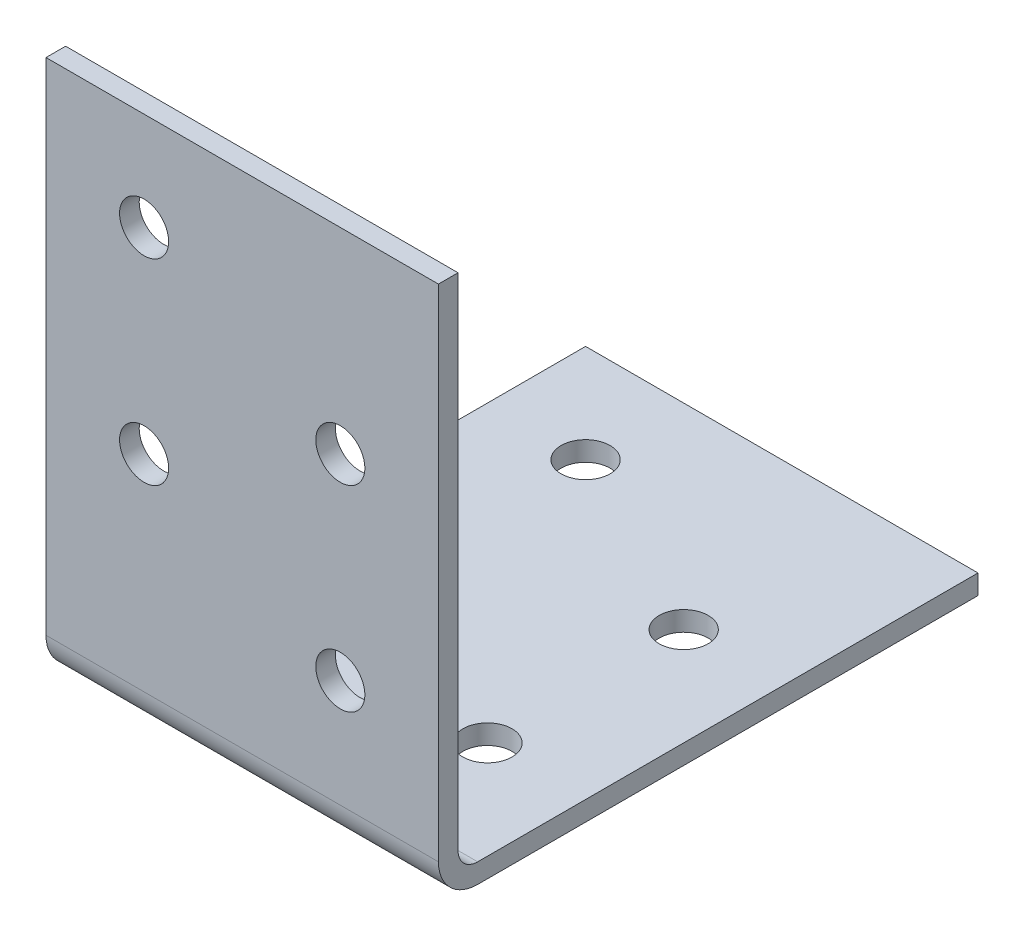
ISO-10303-21;
HEADER;
FILE_DESCRIPTION(('STEP AP214'),'2;1');
FILE_NAME('part.step','',(''),(''),'','','');
FILE_SCHEMA(('AUTOMOTIVE_DESIGN { 1 0 10303 214 1 1 1 1 }'));
ENDSEC;
DATA;
#1=APPLICATION_CONTEXT('core data for automotive mechanical design processes');
#2=APPLICATION_PROTOCOL_DEFINITION('international standard','automotive_design',2000,#1);
#3=PRODUCT_CONTEXT('',#1,'mechanical');
#4=PRODUCT('Part','Part','',(#3));
#5=PRODUCT_RELATED_PRODUCT_CATEGORY('part','',(#4));
#6=PRODUCT_DEFINITION_FORMATION('','',#4);
#7=PRODUCT_DEFINITION_CONTEXT('part definition',#1,'design');
#8=PRODUCT_DEFINITION('design','',#6,#7);
#9=PRODUCT_DEFINITION_SHAPE('','',#8);
#10=(LENGTH_UNIT() NAMED_UNIT(*) SI_UNIT(.MILLI.,.METRE.));
#11=(NAMED_UNIT(*) PLANE_ANGLE_UNIT() SI_UNIT($,.RADIAN.));
#12=(NAMED_UNIT(*) SI_UNIT($,.STERADIAN.) SOLID_ANGLE_UNIT());
#13=UNCERTAINTY_MEASURE_WITH_UNIT(LENGTH_MEASURE(1.E-05),#10,'distance_accuracy_value','');
#14=(GEOMETRIC_REPRESENTATION_CONTEXT(3) GLOBAL_UNCERTAINTY_ASSIGNED_CONTEXT((#13)) GLOBAL_UNIT_ASSIGNED_CONTEXT((#10,
#11,#12)) REPRESENTATION_CONTEXT('',''));
#15=CARTESIAN_POINT('',(0.,0.,0.));
#16=DIRECTION('',(0.,0.,1.));
#17=DIRECTION('',(1.,0.,0.));
#18=AXIS2_PLACEMENT_3D('',#15,#16,#17);
#19=CARTESIAN_POINT('',(20.,55.,0.));
#20=DIRECTION('',(0.,-1.,0.));
#21=DIRECTION('',(0.,0.,-1.));
#22=AXIS2_PLACEMENT_3D('',#19,#20,#21);
#23=PLANE('',#22);
#24=DIRECTION('',(0.,0.,1.));
#25=VECTOR('',#24,1.);
#26=CARTESIAN_POINT('',(-20.,55.,0.));
#27=LINE('',#26,#25);
#28=CARTESIAN_POINT('',(-20.,55.,-2.));
#29=VERTEX_POINT('',#28);
#30=CARTESIAN_POINT('',(-20.,55.,0.));
#31=VERTEX_POINT('',#30);
#32=EDGE_CURVE('E141',#29,#31,#27,.T.);
#33=ORIENTED_EDGE('',*,*,#32,.T.);
#34=DIRECTION('',(-1.,0.,0.));
#35=VECTOR('',#34,1.);
#36=CARTESIAN_POINT('',(20.,55.,0.));
#37=LINE('',#36,#35);
#38=CARTESIAN_POINT('',(20.,55.,0.));
#39=VERTEX_POINT('',#38);
#40=EDGE_CURVE('E11',#39,#31,#37,.T.);
#41=ORIENTED_EDGE('',*,*,#40,.F.);
#42=DIRECTION('',(0.,0.,1.));
#43=VECTOR('',#42,1.);
#44=CARTESIAN_POINT('',(20.,55.,0.));
#45=LINE('',#44,#43);
#46=CARTESIAN_POINT('',(20.,55.,-2.));
#47=VERTEX_POINT('',#46);
#48=EDGE_CURVE('E164',#47,#39,#45,.T.);
#49=ORIENTED_EDGE('',*,*,#48,.F.);
#50=DIRECTION('',(-1.,0.,0.));
#51=VECTOR('',#50,1.);
#52=CARTESIAN_POINT('',(20.,55.,-2.));
#53=LINE('',#52,#51);
#54=EDGE_CURVE('E137',#47,#29,#53,.T.);
#55=ORIENTED_EDGE('',*,*,#54,.T.);
#56=EDGE_LOOP('',(#33,#41,#49,#55));
#57=FACE_BOUND('',#56,.T.);
#58=ADVANCED_FACE('F40',(#57),#23,.F.);
#59=CARTESIAN_POINT('',(20.,55.,0.));
#60=DIRECTION('',(0.,0.,-1.));
#61=DIRECTION('',(0.,1.,0.));
#62=AXIS2_PLACEMENT_3D('',#59,#60,#61);
#63=PLANE('',#62);
#64=CARTESIAN_POINT('',(10.,15.,0.));
#65=DIRECTION('',(0.,0.,-1.));
#66=DIRECTION('',(-1.,0.,0.));
#67=AXIS2_PLACEMENT_3D('',#64,#65,#66);
#68=CIRCLE('',#67,2.5);
#69=CARTESIAN_POINT('',(7.5,15.,0.));
#70=VERTEX_POINT('',#69);
#71=EDGE_CURVE('E263',#70,#70,#68,.T.);
#72=ORIENTED_EDGE('',*,*,#71,.T.);
#73=EDGE_LOOP('',(#72));
#74=FACE_BOUND('',#73,.T.);
#75=CARTESIAN_POINT('',(10.,35.,0.));
#76=DIRECTION('',(0.,0.,-1.));
#77=DIRECTION('',(-1.,0.,0.));
#78=AXIS2_PLACEMENT_3D('',#75,#76,#77);
#79=CIRCLE('',#78,2.5);
#80=CARTESIAN_POINT('',(7.5,35.,0.));
#81=VERTEX_POINT('',#80);
#82=EDGE_CURVE('E255',#81,#81,#79,.T.);
#83=ORIENTED_EDGE('',*,*,#82,.T.);
#84=EDGE_LOOP('',(#83));
#85=FACE_BOUND('',#84,.T.);
#86=CARTESIAN_POINT('',(-10.,25.,0.));
#87=DIRECTION('',(0.,0.,-1.));
#88=DIRECTION('',(-1.,0.,0.));
#89=AXIS2_PLACEMENT_3D('',#86,#87,#88);
#90=CIRCLE('',#89,2.5);
#91=CARTESIAN_POINT('',(-12.5,25.,0.));
#92=VERTEX_POINT('',#91);
#93=EDGE_CURVE('E247',#92,#92,#90,.T.);
#94=ORIENTED_EDGE('',*,*,#93,.T.);
#95=EDGE_LOOP('',(#94));
#96=FACE_BOUND('',#95,.T.);
#97=CARTESIAN_POINT('',(-10.,45.,0.));
#98=DIRECTION('',(0.,0.,-1.));
#99=DIRECTION('',(-1.,0.,0.));
#100=AXIS2_PLACEMENT_3D('',#97,#98,#99);
#101=CIRCLE('',#100,2.5);
#102=CARTESIAN_POINT('',(-12.5,45.,0.));
#103=VERTEX_POINT('',#102);
#104=EDGE_CURVE('E239',#103,#103,#101,.T.);
#105=ORIENTED_EDGE('',*,*,#104,.T.);
#106=EDGE_LOOP('',(#105));
#107=FACE_BOUND('',#106,.T.);
#108=DIRECTION('',(0.,-1.,0.));
#109=VECTOR('',#108,1.);
#110=CARTESIAN_POINT('',(-20.,55.,0.));
#111=LINE('',#110,#109);
#112=CARTESIAN_POINT('',(-20.,4.00000000000003,0.));
#113=VERTEX_POINT('',#112);
#114=EDGE_CURVE('E145',#31,#113,#111,.T.);
#115=ORIENTED_EDGE('',*,*,#114,.T.);
#116=DIRECTION('',(-1.,0.,0.));
#117=VECTOR('',#116,1.);
#118=CARTESIAN_POINT('',(20.,4.00000000000003,0.));
#119=LINE('',#118,#117);
#120=CARTESIAN_POINT('',(20.,4.00000000000003,0.));
#121=VERTEX_POINT('',#120);
#122=EDGE_CURVE('E49',#121,#113,#119,.T.);
#123=ORIENTED_EDGE('',*,*,#122,.F.);
#124=DIRECTION('',(0.,-1.,0.));
#125=VECTOR('',#124,1.);
#126=CARTESIAN_POINT('',(20.,55.,0.));
#127=LINE('',#126,#125);
#128=EDGE_CURVE('E100',#39,#121,#127,.T.);
#129=ORIENTED_EDGE('',*,*,#128,.F.);
#130=ORIENTED_EDGE('',*,*,#40,.T.);
#131=EDGE_LOOP('',(#115,#123,#129,#130));
#132=FACE_BOUND('',#131,.T.);
#133=ADVANCED_FACE('F302',(#74,#85,#96,#107,#132),#63,.F.);
#134=CARTESIAN_POINT('',(20.,4.,-4.));
#135=DIRECTION('',(-1.,0.,0.));
#136=DIRECTION('',(0.,0.,1.));
#137=AXIS2_PLACEMENT_3D('',#134,#135,#136);
#138=CYLINDRICAL_SURFACE('',#137,4.);
#139=CARTESIAN_POINT('',(-20.,4.,-4.));
#140=DIRECTION('',(1.,0.,0.));
#141=DIRECTION('',(0.,0.,-1.));
#142=AXIS2_PLACEMENT_3D('',#139,#140,#141);
#143=CIRCLE('',#142,4.);
#144=CARTESIAN_POINT('',(-20.,0.,-4.00000000000003));
#145=VERTEX_POINT('',#144);
#146=EDGE_CURVE('E149',#113,#145,#143,.T.);
#147=ORIENTED_EDGE('',*,*,#146,.T.);
#148=DIRECTION('',(-1.,0.,0.));
#149=VECTOR('',#148,1.);
#150=CARTESIAN_POINT('',(20.,0.,-4.00000000000003));
#151=LINE('',#150,#149);
#152=CARTESIAN_POINT('',(20.,0.,-4.00000000000003));
#153=VERTEX_POINT('',#152);
#154=EDGE_CURVE('E175',#153,#145,#151,.T.);
#155=ORIENTED_EDGE('',*,*,#154,.F.);
#156=CARTESIAN_POINT('',(20.,4.,-4.));
#157=DIRECTION('',(1.,0.,0.));
#158=DIRECTION('',(0.,0.,-1.));
#159=AXIS2_PLACEMENT_3D('',#156,#157,#158);
#160=CIRCLE('',#159,4.);
#161=EDGE_CURVE('E185',#121,#153,#160,.T.);
#162=ORIENTED_EDGE('',*,*,#161,.F.);
#163=ORIENTED_EDGE('',*,*,#122,.T.);
#164=EDGE_LOOP('',(#147,#155,#162,#163));
#165=FACE_BOUND('',#164,.T.);
#166=ADVANCED_FACE('F183',(#165),#138,.T.);
#167=CARTESIAN_POINT('',(20.,0.,-4.00000000000003));
#168=DIRECTION('',(0.,1.,0.));
#169=DIRECTION('',(0.,0.,1.));
#170=AXIS2_PLACEMENT_3D('',#167,#168,#169);
#171=PLANE('',#170);
#172=CARTESIAN_POINT('',(-10.,0.,-45.));
#173=DIRECTION('',(0.,1.,0.));
#174=DIRECTION('',(0.,0.,1.));
#175=AXIS2_PLACEMENT_3D('',#172,#173,#174);
#176=CIRCLE('',#175,2.5);
#177=CARTESIAN_POINT('',(-10.,0.,-42.5));
#178=VERTEX_POINT('',#177);
#179=EDGE_CURVE('E231',#178,#178,#176,.T.);
#180=ORIENTED_EDGE('',*,*,#179,.T.);
#181=EDGE_LOOP('',(#180));
#182=FACE_BOUND('',#181,.T.);
#183=CARTESIAN_POINT('',(-10.,0.,-25.));
#184=DIRECTION('',(0.,1.,0.));
#185=DIRECTION('',(0.,0.,1.));
#186=AXIS2_PLACEMENT_3D('',#183,#184,#185);
#187=CIRCLE('',#186,2.5);
#188=CARTESIAN_POINT('',(-10.,0.,-22.5));
#189=VERTEX_POINT('',#188);
#190=EDGE_CURVE('E223',#189,#189,#187,.T.);
#191=ORIENTED_EDGE('',*,*,#190,.T.);
#192=EDGE_LOOP('',(#191));
#193=FACE_BOUND('',#192,.T.);
#194=CARTESIAN_POINT('',(10.,0.,-35.));
#195=DIRECTION('',(0.,1.,0.));
#196=DIRECTION('',(0.,0.,1.));
#197=AXIS2_PLACEMENT_3D('',#194,#195,#196);
#198=CIRCLE('',#197,2.5);
#199=CARTESIAN_POINT('',(10.,0.,-32.5));
#200=VERTEX_POINT('',#199);
#201=EDGE_CURVE('E215',#200,#200,#198,.T.);
#202=ORIENTED_EDGE('',*,*,#201,.T.);
#203=EDGE_LOOP('',(#202));
#204=FACE_BOUND('',#203,.T.);
#205=CARTESIAN_POINT('',(10.,0.,-15.));
#206=DIRECTION('',(0.,1.,0.));
#207=DIRECTION('',(0.,0.,1.));
#208=AXIS2_PLACEMENT_3D('',#205,#206,#207);
#209=CIRCLE('',#208,2.5);
#210=CARTESIAN_POINT('',(10.,0.,-12.5));
#211=VERTEX_POINT('',#210);
#212=EDGE_CURVE('E146',#211,#211,#209,.T.);
#213=ORIENTED_EDGE('',*,*,#212,.T.);
#214=EDGE_LOOP('',(#213));
#215=FACE_BOUND('',#214,.T.);
#216=DIRECTION('',(0.,0.,-1.));
#217=VECTOR('',#216,1.);
#218=CARTESIAN_POINT('',(-20.,0.,-4.00000000000003));
#219=LINE('',#218,#217);
#220=CARTESIAN_POINT('',(-20.,0.,-55.));
#221=VERTEX_POINT('',#220);
#222=EDGE_CURVE('E152',#145,#221,#219,.T.);
#223=ORIENTED_EDGE('',*,*,#222,.T.);
#224=DIRECTION('',(-1.,0.,0.));
#225=VECTOR('',#224,1.);
#226=CARTESIAN_POINT('',(20.,0.,-55.));
#227=LINE('',#226,#225);
#228=CARTESIAN_POINT('',(20.,0.,-55.));
#229=VERTEX_POINT('',#228);
#230=EDGE_CURVE('E171',#229,#221,#227,.T.);
#231=ORIENTED_EDGE('',*,*,#230,.F.);
#232=DIRECTION('',(0.,0.,-1.));
#233=VECTOR('',#232,1.);
#234=CARTESIAN_POINT('',(20.,0.,-4.00000000000003));
#235=LINE('',#234,#233);
#236=EDGE_CURVE('E198',#153,#229,#235,.T.);
#237=ORIENTED_EDGE('',*,*,#236,.F.);
#238=ORIENTED_EDGE('',*,*,#154,.T.);
#239=EDGE_LOOP('',(#223,#231,#237,#238));
#240=FACE_BOUND('',#239,.T.);
#241=ADVANCED_FACE('F193',(#182,#193,#204,#215,#240),#171,.F.);
#242=CARTESIAN_POINT('',(20.,2.,-55.));
#243=DIRECTION('',(0.,0.,1.));
#244=DIRECTION('',(1.,0.,0.));
#245=AXIS2_PLACEMENT_3D('',#242,#243,#244);
#246=PLANE('',#245);
#247=DIRECTION('',(0.,1.,0.));
#248=VECTOR('',#247,1.);
#249=CARTESIAN_POINT('',(-20.,2.,-55.));
#250=LINE('',#249,#248);
#251=CARTESIAN_POINT('',(-20.,2.,-55.));
#252=VERTEX_POINT('',#251);
#253=EDGE_CURVE('E155',#221,#252,#250,.T.);
#254=ORIENTED_EDGE('',*,*,#253,.T.);
#255=DIRECTION('',(-1.,0.,0.));
#256=VECTOR('',#255,1.);
#257=CARTESIAN_POINT('',(20.,2.,-55.));
#258=LINE('',#257,#256);
#259=CARTESIAN_POINT('',(20.,2.,-55.));
#260=VERTEX_POINT('',#259);
#261=EDGE_CURVE('E130',#260,#252,#258,.T.);
#262=ORIENTED_EDGE('',*,*,#261,.F.);
#263=DIRECTION('',(0.,1.,0.));
#264=VECTOR('',#263,1.);
#265=CARTESIAN_POINT('',(20.,2.,-55.));
#266=LINE('',#265,#264);
#267=EDGE_CURVE('E119',#229,#260,#266,.T.);
#268=ORIENTED_EDGE('',*,*,#267,.F.);
#269=ORIENTED_EDGE('',*,*,#230,.T.);
#270=EDGE_LOOP('',(#254,#262,#268,#269));
#271=FACE_BOUND('',#270,.T.);
#272=ADVANCED_FACE('F196',(#271),#246,.F.);
#273=CARTESIAN_POINT('',(20.,2.,-4.00000000000001));
#274=DIRECTION('',(0.,-1.,0.));
#275=DIRECTION('',(0.,0.,-1.));
#276=AXIS2_PLACEMENT_3D('',#273,#274,#275);
#277=PLANE('',#276);
#278=CARTESIAN_POINT('',(-10.,2.,-45.));
#279=DIRECTION('',(0.,1.,0.));
#280=DIRECTION('',(0.,0.,1.));
#281=AXIS2_PLACEMENT_3D('',#278,#279,#280);
#282=CIRCLE('',#281,2.5);
#283=CARTESIAN_POINT('',(-10.,2.,-42.5));
#284=VERTEX_POINT('',#283);
#285=EDGE_CURVE('E235',#284,#284,#282,.T.);
#286=ORIENTED_EDGE('',*,*,#285,.F.);
#287=EDGE_LOOP('',(#286));
#288=FACE_BOUND('',#287,.T.);
#289=CARTESIAN_POINT('',(-10.,2.,-25.));
#290=DIRECTION('',(0.,1.,0.));
#291=DIRECTION('',(0.,0.,1.));
#292=AXIS2_PLACEMENT_3D('',#289,#290,#291);
#293=CIRCLE('',#292,2.5);
#294=CARTESIAN_POINT('',(-10.,2.,-22.5));
#295=VERTEX_POINT('',#294);
#296=EDGE_CURVE('E227',#295,#295,#293,.T.);
#297=ORIENTED_EDGE('',*,*,#296,.F.);
#298=EDGE_LOOP('',(#297));
#299=FACE_BOUND('',#298,.T.);
#300=CARTESIAN_POINT('',(10.,2.,-35.));
#301=DIRECTION('',(0.,1.,0.));
#302=DIRECTION('',(0.,0.,1.));
#303=AXIS2_PLACEMENT_3D('',#300,#301,#302);
#304=CIRCLE('',#303,2.5);
#305=CARTESIAN_POINT('',(10.,2.,-32.5));
#306=VERTEX_POINT('',#305);
#307=EDGE_CURVE('E219',#306,#306,#304,.T.);
#308=ORIENTED_EDGE('',*,*,#307,.F.);
#309=EDGE_LOOP('',(#308));
#310=FACE_BOUND('',#309,.T.);
#311=CARTESIAN_POINT('',(10.,2.,-15.));
#312=DIRECTION('',(0.,1.,0.));
#313=DIRECTION('',(0.,0.,1.));
#314=AXIS2_PLACEMENT_3D('',#311,#312,#313);
#315=CIRCLE('',#314,2.5);
#316=CARTESIAN_POINT('',(10.,2.,-12.5));
#317=VERTEX_POINT('',#316);
#318=EDGE_CURVE('E211',#317,#317,#315,.T.);
#319=ORIENTED_EDGE('',*,*,#318,.F.);
#320=EDGE_LOOP('',(#319));
#321=FACE_BOUND('',#320,.T.);
#322=DIRECTION('',(0.,0.,1.));
#323=VECTOR('',#322,1.);
#324=CARTESIAN_POINT('',(-20.,2.,-4.00000000000001));
#325=LINE('',#324,#323);
#326=CARTESIAN_POINT('',(-20.,2.,-4.00000000000001));
#327=VERTEX_POINT('',#326);
#328=EDGE_CURVE('E128',#252,#327,#325,.T.);
#329=ORIENTED_EDGE('',*,*,#328,.T.);
#330=DIRECTION('',(-1.,0.,0.));
#331=VECTOR('',#330,1.);
#332=CARTESIAN_POINT('',(20.,2.,-4.00000000000001));
#333=LINE('',#332,#331);
#334=CARTESIAN_POINT('',(20.,2.,-4.00000000000001));
#335=VERTEX_POINT('',#334);
#336=EDGE_CURVE('E125',#335,#327,#333,.T.);
#337=ORIENTED_EDGE('',*,*,#336,.F.);
#338=DIRECTION('',(0.,0.,1.));
#339=VECTOR('',#338,1.);
#340=CARTESIAN_POINT('',(20.,2.,-4.00000000000001));
#341=LINE('',#340,#339);
#342=EDGE_CURVE('E113',#260,#335,#341,.T.);
#343=ORIENTED_EDGE('',*,*,#342,.F.);
#344=ORIENTED_EDGE('',*,*,#261,.T.);
#345=EDGE_LOOP('',(#329,#337,#343,#344));
#346=FACE_BOUND('',#345,.T.);
#347=ADVANCED_FACE('F126',(#288,#299,#310,#321,#346),#277,.F.);
#348=CARTESIAN_POINT('',(20.,4.,-4.));
#349=DIRECTION('',(-1.,0.,0.));
#350=DIRECTION('',(0.,0.,1.));
#351=AXIS2_PLACEMENT_3D('',#348,#349,#350);
#352=CYLINDRICAL_SURFACE('',#351,2.);
#353=CARTESIAN_POINT('',(-20.,4.,-4.));
#354=DIRECTION('',(-1.,0.,0.));
#355=DIRECTION('',(0.,0.,-1.));
#356=AXIS2_PLACEMENT_3D('',#353,#354,#355);
#357=CIRCLE('',#356,2.);
#358=CARTESIAN_POINT('',(-20.,4.00000000000003,-2.));
#359=VERTEX_POINT('',#358);
#360=EDGE_CURVE('E86',#327,#359,#357,.T.);
#361=ORIENTED_EDGE('',*,*,#360,.T.);
#362=DIRECTION('',(-1.,0.,0.));
#363=VECTOR('',#362,1.);
#364=CARTESIAN_POINT('',(20.,4.00000000000003,-2.));
#365=LINE('',#364,#363);
#366=CARTESIAN_POINT('',(20.,4.00000000000003,-2.));
#367=VERTEX_POINT('',#366);
#368=EDGE_CURVE('E131',#367,#359,#365,.T.);
#369=ORIENTED_EDGE('',*,*,#368,.F.);
#370=CARTESIAN_POINT('',(20.,4.,-4.));
#371=DIRECTION('',(-1.,0.,0.));
#372=DIRECTION('',(0.,0.,-1.));
#373=AXIS2_PLACEMENT_3D('',#370,#371,#372);
#374=CIRCLE('',#373,2.);
#375=EDGE_CURVE('E117',#335,#367,#374,.T.);
#376=ORIENTED_EDGE('',*,*,#375,.F.);
#377=ORIENTED_EDGE('',*,*,#336,.T.);
#378=EDGE_LOOP('',(#361,#369,#376,#377));
#379=FACE_BOUND('',#378,.T.);
#380=ADVANCED_FACE('F133',(#379),#352,.F.);
#381=CARTESIAN_POINT('',(20.,55.,-2.));
#382=DIRECTION('',(0.,0.,1.));
#383=DIRECTION('',(0.,-1.,0.));
#384=AXIS2_PLACEMENT_3D('',#381,#382,#383);
#385=PLANE('',#384);
#386=CARTESIAN_POINT('',(10.,15.,-2.));
#387=DIRECTION('',(0.,0.,-1.));
#388=DIRECTION('',(-1.,0.,0.));
#389=AXIS2_PLACEMENT_3D('',#386,#387,#388);
#390=CIRCLE('',#389,2.5);
#391=CARTESIAN_POINT('',(7.5,15.,-2.));
#392=VERTEX_POINT('',#391);
#393=EDGE_CURVE('E267',#392,#392,#390,.T.);
#394=ORIENTED_EDGE('',*,*,#393,.F.);
#395=EDGE_LOOP('',(#394));
#396=FACE_BOUND('',#395,.T.);
#397=CARTESIAN_POINT('',(10.,35.,-2.));
#398=DIRECTION('',(0.,0.,-1.));
#399=DIRECTION('',(-1.,0.,0.));
#400=AXIS2_PLACEMENT_3D('',#397,#398,#399);
#401=CIRCLE('',#400,2.5);
#402=CARTESIAN_POINT('',(7.5,35.,-2.));
#403=VERTEX_POINT('',#402);
#404=EDGE_CURVE('E259',#403,#403,#401,.T.);
#405=ORIENTED_EDGE('',*,*,#404,.F.);
#406=EDGE_LOOP('',(#405));
#407=FACE_BOUND('',#406,.T.);
#408=CARTESIAN_POINT('',(-10.,25.,-2.));
#409=DIRECTION('',(0.,0.,-1.));
#410=DIRECTION('',(-1.,0.,0.));
#411=AXIS2_PLACEMENT_3D('',#408,#409,#410);
#412=CIRCLE('',#411,2.5);
#413=CARTESIAN_POINT('',(-12.5,25.,-2.));
#414=VERTEX_POINT('',#413);
#415=EDGE_CURVE('E251',#414,#414,#412,.T.);
#416=ORIENTED_EDGE('',*,*,#415,.F.);
#417=EDGE_LOOP('',(#416));
#418=FACE_BOUND('',#417,.T.);
#419=CARTESIAN_POINT('',(-10.,45.,-2.));
#420=DIRECTION('',(0.,0.,-1.));
#421=DIRECTION('',(-1.,0.,0.));
#422=AXIS2_PLACEMENT_3D('',#419,#420,#421);
#423=CIRCLE('',#422,2.5);
#424=CARTESIAN_POINT('',(-12.5,45.,-2.));
#425=VERTEX_POINT('',#424);
#426=EDGE_CURVE('E243',#425,#425,#423,.T.);
#427=ORIENTED_EDGE('',*,*,#426,.F.);
#428=EDGE_LOOP('',(#427));
#429=FACE_BOUND('',#428,.T.);
#430=DIRECTION('',(0.,1.,0.));
#431=VECTOR('',#430,1.);
#432=CARTESIAN_POINT('',(-20.,55.,-2.));
#433=LINE('',#432,#431);
#434=EDGE_CURVE('E92',#359,#29,#433,.T.);
#435=ORIENTED_EDGE('',*,*,#434,.T.);
#436=ORIENTED_EDGE('',*,*,#54,.F.);
#437=DIRECTION('',(0.,1.,0.));
#438=VECTOR('',#437,1.);
#439=CARTESIAN_POINT('',(20.,55.,-2.));
#440=LINE('',#439,#438);
#441=EDGE_CURVE('E57',#367,#47,#440,.T.);
#442=ORIENTED_EDGE('',*,*,#441,.F.);
#443=ORIENTED_EDGE('',*,*,#368,.T.);
#444=EDGE_LOOP('',(#435,#436,#442,#443));
#445=FACE_BOUND('',#444,.T.);
#446=ADVANCED_FACE('F274',(#396,#407,#418,#429,#445),#385,.F.);
#447=CARTESIAN_POINT('',(20.,4.,-4.));
#448=DIRECTION('',(1.,0.,0.));
#449=DIRECTION('',(0.,0.,-1.));
#450=AXIS2_PLACEMENT_3D('',#447,#448,#449);
#451=PLANE('',#450);
#452=ORIENTED_EDGE('',*,*,#48,.T.);
#453=ORIENTED_EDGE('',*,*,#128,.T.);
#454=ORIENTED_EDGE('',*,*,#161,.T.);
#455=ORIENTED_EDGE('',*,*,#236,.T.);
#456=ORIENTED_EDGE('',*,*,#267,.T.);
#457=ORIENTED_EDGE('',*,*,#342,.T.);
#458=ORIENTED_EDGE('',*,*,#375,.T.);
#459=ORIENTED_EDGE('',*,*,#441,.T.);
#460=EDGE_LOOP('',(#452,#453,#454,#455,#456,#457,#458,#459));
#461=FACE_BOUND('',#460,.T.);
#462=ADVANCED_FACE('F115',(#461),#451,.T.);
#463=CARTESIAN_POINT('',(-20.,4.,-4.));
#464=DIRECTION('',(1.,0.,0.));
#465=DIRECTION('',(0.,0.,-1.));
#466=AXIS2_PLACEMENT_3D('',#463,#464,#465);
#467=PLANE('',#466);
#468=ORIENTED_EDGE('',*,*,#32,.F.);
#469=ORIENTED_EDGE('',*,*,#434,.F.);
#470=ORIENTED_EDGE('',*,*,#360,.F.);
#471=ORIENTED_EDGE('',*,*,#328,.F.);
#472=ORIENTED_EDGE('',*,*,#253,.F.);
#473=ORIENTED_EDGE('',*,*,#222,.F.);
#474=ORIENTED_EDGE('',*,*,#146,.F.);
#475=ORIENTED_EDGE('',*,*,#114,.F.);
#476=EDGE_LOOP('',(#468,#469,#470,#471,#472,#473,#474,#475));
#477=FACE_BOUND('',#476,.T.);
#478=ADVANCED_FACE('F189',(#477),#467,.F.);
#479=CARTESIAN_POINT('',(10.,2.,-15.));
#480=DIRECTION('',(0.,1.,0.));
#481=DIRECTION('',(0.,0.,1.));
#482=AXIS2_PLACEMENT_3D('',#479,#480,#481);
#483=CYLINDRICAL_SURFACE('',#482,2.5);
#484=ORIENTED_EDGE('',*,*,#212,.F.);
#485=EDGE_LOOP('',(#484));
#486=FACE_BOUND('',#485,.T.);
#487=ORIENTED_EDGE('',*,*,#318,.T.);
#488=EDGE_LOOP('',(#487));
#489=FACE_BOUND('',#488,.T.);
#490=ADVANCED_FACE('F328',(#486,#489),#483,.F.);
#491=CARTESIAN_POINT('',(10.,2.,-35.));
#492=DIRECTION('',(0.,1.,0.));
#493=DIRECTION('',(0.,0.,1.));
#494=AXIS2_PLACEMENT_3D('',#491,#492,#493);
#495=CYLINDRICAL_SURFACE('',#494,2.5);
#496=ORIENTED_EDGE('',*,*,#201,.F.);
#497=EDGE_LOOP('',(#496));
#498=FACE_BOUND('',#497,.T.);
#499=ORIENTED_EDGE('',*,*,#307,.T.);
#500=EDGE_LOOP('',(#499));
#501=FACE_BOUND('',#500,.T.);
#502=ADVANCED_FACE('F333',(#498,#501),#495,.F.);
#503=CARTESIAN_POINT('',(-10.,2.,-25.));
#504=DIRECTION('',(0.,1.,0.));
#505=DIRECTION('',(0.,0.,1.));
#506=AXIS2_PLACEMENT_3D('',#503,#504,#505);
#507=CYLINDRICAL_SURFACE('',#506,2.5);
#508=ORIENTED_EDGE('',*,*,#190,.F.);
#509=EDGE_LOOP('',(#508));
#510=FACE_BOUND('',#509,.T.);
#511=ORIENTED_EDGE('',*,*,#296,.T.);
#512=EDGE_LOOP('',(#511));
#513=FACE_BOUND('',#512,.T.);
#514=ADVANCED_FACE('F297',(#510,#513),#507,.F.);
#515=CARTESIAN_POINT('',(-10.,2.,-45.));
#516=DIRECTION('',(0.,1.,0.));
#517=DIRECTION('',(0.,0.,1.));
#518=AXIS2_PLACEMENT_3D('',#515,#516,#517);
#519=CYLINDRICAL_SURFACE('',#518,2.5);
#520=ORIENTED_EDGE('',*,*,#179,.F.);
#521=EDGE_LOOP('',(#520));
#522=FACE_BOUND('',#521,.T.);
#523=ORIENTED_EDGE('',*,*,#285,.T.);
#524=EDGE_LOOP('',(#523));
#525=FACE_BOUND('',#524,.T.);
#526=ADVANCED_FACE('F287',(#522,#525),#519,.F.);
#527=CARTESIAN_POINT('',(-10.,45.,-2.));
#528=DIRECTION('',(0.,0.,-1.));
#529=DIRECTION('',(-1.,0.,0.));
#530=AXIS2_PLACEMENT_3D('',#527,#528,#529);
#531=CYLINDRICAL_SURFACE('',#530,2.5);
#532=ORIENTED_EDGE('',*,*,#104,.F.);
#533=EDGE_LOOP('',(#532));
#534=FACE_BOUND('',#533,.T.);
#535=ORIENTED_EDGE('',*,*,#426,.T.);
#536=EDGE_LOOP('',(#535));
#537=FACE_BOUND('',#536,.T.);
#538=ADVANCED_FACE('F284',(#534,#537),#531,.F.);
#539=CARTESIAN_POINT('',(-10.,25.,-2.));
#540=DIRECTION('',(0.,0.,-1.));
#541=DIRECTION('',(-1.,0.,0.));
#542=AXIS2_PLACEMENT_3D('',#539,#540,#541);
#543=CYLINDRICAL_SURFACE('',#542,2.5);
#544=ORIENTED_EDGE('',*,*,#93,.F.);
#545=EDGE_LOOP('',(#544));
#546=FACE_BOUND('',#545,.T.);
#547=ORIENTED_EDGE('',*,*,#415,.T.);
#548=EDGE_LOOP('',(#547));
#549=FACE_BOUND('',#548,.T.);
#550=ADVANCED_FACE('F286',(#546,#549),#543,.F.);
#551=CARTESIAN_POINT('',(10.,35.,-2.));
#552=DIRECTION('',(0.,0.,-1.));
#553=DIRECTION('',(-1.,0.,0.));
#554=AXIS2_PLACEMENT_3D('',#551,#552,#553);
#555=CYLINDRICAL_SURFACE('',#554,2.5);
#556=ORIENTED_EDGE('',*,*,#82,.F.);
#557=EDGE_LOOP('',(#556));
#558=FACE_BOUND('',#557,.T.);
#559=ORIENTED_EDGE('',*,*,#404,.T.);
#560=EDGE_LOOP('',(#559));
#561=FACE_BOUND('',#560,.T.);
#562=ADVANCED_FACE('F294',(#558,#561),#555,.F.);
#563=CARTESIAN_POINT('',(10.,15.,-2.));
#564=DIRECTION('',(0.,0.,-1.));
#565=DIRECTION('',(-1.,0.,0.));
#566=AXIS2_PLACEMENT_3D('',#563,#564,#565);
#567=CYLINDRICAL_SURFACE('',#566,2.5);
#568=ORIENTED_EDGE('',*,*,#71,.F.);
#569=EDGE_LOOP('',(#568));
#570=FACE_BOUND('',#569,.T.);
#571=ORIENTED_EDGE('',*,*,#393,.T.);
#572=EDGE_LOOP('',(#571));
#573=FACE_BOUND('',#572,.T.);
#574=ADVANCED_FACE('F272',(#570,#573),#567,.F.);
#575=CLOSED_SHELL('',(#58,#133,#166,#241,#272,#347,#380,#446,#462,#478,#490,#502,#514,#526,#538,
#550,#562,#574));
#576=MANIFOLD_SOLID_BREP('B2',#575);
#577=ADVANCED_BREP_SHAPE_REPRESENTATION('',(#18,#576),#14);
#578=SHAPE_DEFINITION_REPRESENTATION(#9,#577);
ENDSEC;
END-ISO-10303-21;
